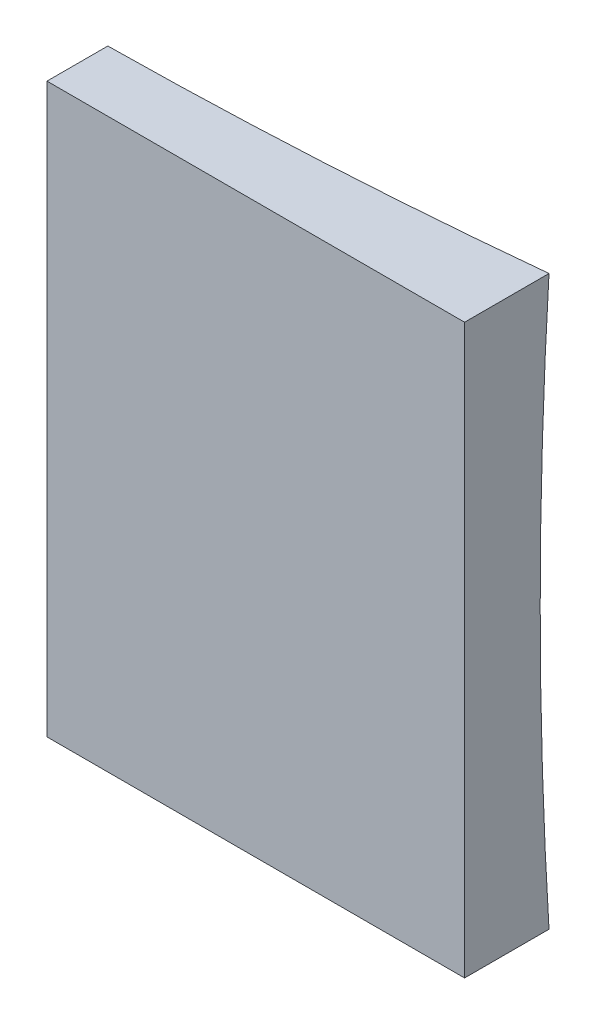
ISO-10303-21;
HEADER;
FILE_DESCRIPTION(('STEP AP214'),'2;1');
FILE_NAME('part.step','',(''),(''),'','','');
FILE_SCHEMA(('AUTOMOTIVE_DESIGN { 1 0 10303 214 1 1 1 1 }'));
ENDSEC;
DATA;
#1=APPLICATION_CONTEXT('core data for automotive mechanical design processes');
#2=APPLICATION_PROTOCOL_DEFINITION('international standard','automotive_design',2000,#1);
#3=PRODUCT_CONTEXT('',#1,'mechanical');
#4=PRODUCT('Part','Part','',(#3));
#5=PRODUCT_RELATED_PRODUCT_CATEGORY('part','',(#4));
#6=PRODUCT_DEFINITION_FORMATION('','',#4);
#7=PRODUCT_DEFINITION_CONTEXT('part definition',#1,'design');
#8=PRODUCT_DEFINITION('design','',#6,#7);
#9=PRODUCT_DEFINITION_SHAPE('','',#8);
#10=(LENGTH_UNIT() NAMED_UNIT(*) SI_UNIT(.MILLI.,.METRE.));
#11=(NAMED_UNIT(*) PLANE_ANGLE_UNIT() SI_UNIT($,.RADIAN.));
#12=(NAMED_UNIT(*) SI_UNIT($,.STERADIAN.) SOLID_ANGLE_UNIT());
#13=UNCERTAINTY_MEASURE_WITH_UNIT(LENGTH_MEASURE(1.E-05),#10,'distance_accuracy_value','');
#14=(GEOMETRIC_REPRESENTATION_CONTEXT(3) GLOBAL_UNCERTAINTY_ASSIGNED_CONTEXT((#13)) GLOBAL_UNIT_ASSIGNED_CONTEXT((#10,
#11,#12)) REPRESENTATION_CONTEXT('',''));
#15=CARTESIAN_POINT('',(0.,0.,0.));
#16=DIRECTION('',(0.,0.,1.));
#17=DIRECTION('',(1.,0.,0.));
#18=AXIS2_PLACEMENT_3D('',#15,#16,#17);
#19=CARTESIAN_POINT('',(28.,0.,-8.));
#20=DIRECTION('',(1.,0.,0.));
#21=DIRECTION('',(0.,0.,-1.));
#22=AXIS2_PLACEMENT_3D('',#19,#20,#21);
#23=PLANE('',#22);
#24=CARTESIAN_POINT('',(28.,17.,-278.5));
#25=DIRECTION('',(1.,0.,0.));
#26=DIRECTION('',(0.,0.,-1.));
#27=AXIS2_PLACEMENT_3D('',#24,#25,#26);
#28=CIRCLE('',#27,273.972918369681);
#29=CARTESIAN_POINT('',(28.,34.,-5.05501467388342));
#30=VERTEX_POINT('',#29);
#31=CARTESIAN_POINT('',(28.,0.,-5.05501467388347));
#32=VERTEX_POINT('',#31);
#33=EDGE_CURVE('E54',#30,#32,#28,.T.);
#34=ORIENTED_EDGE('',*,*,#33,.F.);
#35=DIRECTION('',(0.,0.,1.));
#36=VECTOR('',#35,1.);
#37=CARTESIAN_POINT('',(28.,34.,-8.));
#38=LINE('',#37,#36);
#39=CARTESIAN_POINT('',(28.,34.,0.));
#40=VERTEX_POINT('',#39);
#41=EDGE_CURVE('E98',#30,#40,#38,.T.);
#42=ORIENTED_EDGE('',*,*,#41,.T.);
#43=DIRECTION('',(0.,1.,0.));
#44=VECTOR('',#43,1.);
#45=CARTESIAN_POINT('',(28.,0.,0.));
#46=LINE('',#45,#44);
#47=CARTESIAN_POINT('',(28.,0.,0.));
#48=VERTEX_POINT('',#47);
#49=EDGE_CURVE('E90',#48,#40,#46,.T.);
#50=ORIENTED_EDGE('',*,*,#49,.F.);
#51=DIRECTION('',(0.,0.,1.));
#52=VECTOR('',#51,1.);
#53=CARTESIAN_POINT('',(28.,0.,-8.));
#54=LINE('',#53,#52);
#55=EDGE_CURVE('E88',#32,#48,#54,.T.);
#56=ORIENTED_EDGE('',*,*,#55,.F.);
#57=EDGE_LOOP('',(#34,#42,#50,#56));
#58=FACE_BOUND('',#57,.T.);
#59=ADVANCED_FACE('F32',(#58),#23,.T.);
#60=CARTESIAN_POINT('',(-28.,34.,0.));
#61=DIRECTION('',(0.,0.,-1.));
#62=DIRECTION('',(-1.,0.,0.));
#63=AXIS2_PLACEMENT_3D('',#60,#61,#62);
#64=PLANE('',#63);
#65=DIRECTION('',(-1.,0.,0.));
#66=VECTOR('',#65,1.);
#67=CARTESIAN_POINT('',(-28.,34.,0.));
#68=LINE('',#67,#66);
#69=CARTESIAN_POINT('',(3.,34.,0.));
#70=VERTEX_POINT('',#69);
#71=EDGE_CURVE('E85',#40,#70,#68,.T.);
#72=ORIENTED_EDGE('',*,*,#71,.T.);
#73=DIRECTION('',(0.,1.,0.));
#74=VECTOR('',#73,1.);
#75=CARTESIAN_POINT('',(3.,0.,0.));
#76=LINE('',#75,#74);
#77=CARTESIAN_POINT('',(3.,0.,0.));
#78=VERTEX_POINT('',#77);
#79=EDGE_CURVE('E74',#78,#70,#76,.T.);
#80=ORIENTED_EDGE('',*,*,#79,.F.);
#81=DIRECTION('',(1.,0.,0.));
#82=VECTOR('',#81,1.);
#83=CARTESIAN_POINT('',(-28.,0.,0.));
#84=LINE('',#83,#82);
#85=EDGE_CURVE('E82',#78,#48,#84,.T.);
#86=ORIENTED_EDGE('',*,*,#85,.T.);
#87=ORIENTED_EDGE('',*,*,#49,.T.);
#88=EDGE_LOOP('',(#72,#80,#86,#87));
#89=FACE_BOUND('',#88,.T.);
#90=ADVANCED_FACE('F80',(#89),#64,.F.);
#91=CARTESIAN_POINT('',(0.,17.,-278.5));
#92=DIRECTION('',(0.,1.,0.));
#93=DIRECTION('',(0.,0.,1.));
#94=AXIS2_PLACEMENT_3D('',#91,#92,#93);
#95=SPHERICAL_SURFACE('',#94,275.4);
#96=CARTESIAN_POINT('',(0.,0.,-278.5));
#97=DIRECTION('',(0.,-1.,0.));
#98=DIRECTION('',(0.,0.,-1.));
#99=AXIS2_PLACEMENT_3D('',#96,#97,#98);
#100=CIRCLE('',#99,274.874807867145);
#101=CARTESIAN_POINT('',(3.,0.,-3.64156370960694));
#102=VERTEX_POINT('',#101);
#103=EDGE_CURVE('E40',#32,#102,#100,.T.);
#104=ORIENTED_EDGE('',*,*,#103,.T.);
#105=CARTESIAN_POINT('',(3.,17.,-278.5));
#106=DIRECTION('',(1.,0.,0.));
#107=DIRECTION('',(0.,1.,0.));
#108=AXIS2_PLACEMENT_3D('',#105,#106,#107);
#109=CIRCLE('',#108,275.383659645957);
#110=CARTESIAN_POINT('',(3.,34.,-3.64156370960697));
#111=VERTEX_POINT('',#110);
#112=EDGE_CURVE('E11',#102,#111,#109,.F.);
#113=ORIENTED_EDGE('',*,*,#112,.T.);
#114=CARTESIAN_POINT('',(0.,34.,-278.5));
#115=DIRECTION('',(0.,1.,0.));
#116=DIRECTION('',(0.,0.,1.));
#117=AXIS2_PLACEMENT_3D('',#114,#115,#116);
#118=CIRCLE('',#117,274.874807867145);
#119=EDGE_CURVE('E91',#111,#30,#118,.T.);
#120=ORIENTED_EDGE('',*,*,#119,.T.);
#121=ORIENTED_EDGE('',*,*,#33,.T.);
#122=EDGE_LOOP('',(#104,#113,#120,#121));
#123=FACE_BOUND('',#122,.T.);
#124=ADVANCED_FACE('F100',(#123),#95,.F.);
#125=CARTESIAN_POINT('',(-28.,0.,-8.));
#126=DIRECTION('',(0.,-1.,0.));
#127=DIRECTION('',(0.,0.,-1.));
#128=AXIS2_PLACEMENT_3D('',#125,#126,#127);
#129=PLANE('',#128);
#130=DIRECTION('',(0.,0.,1.));
#131=VECTOR('',#130,1.);
#132=CARTESIAN_POINT('',(3.,0.,-5.05501467388347));
#133=LINE('',#132,#131);
#134=EDGE_CURVE('E71',#102,#78,#133,.T.);
#135=ORIENTED_EDGE('',*,*,#134,.F.);
#136=ORIENTED_EDGE('',*,*,#103,.F.);
#137=ORIENTED_EDGE('',*,*,#55,.T.);
#138=ORIENTED_EDGE('',*,*,#85,.F.);
#139=EDGE_LOOP('',(#135,#136,#137,#138));
#140=FACE_BOUND('',#139,.T.);
#141=ADVANCED_FACE('F34',(#140),#129,.T.);
#142=CARTESIAN_POINT('',(-28.,34.,-8.));
#143=DIRECTION('',(0.,1.,0.));
#144=DIRECTION('',(0.,0.,1.));
#145=AXIS2_PLACEMENT_3D('',#142,#143,#144);
#146=PLANE('',#145);
#147=DIRECTION('',(0.,0.,1.));
#148=VECTOR('',#147,1.);
#149=CARTESIAN_POINT('',(3.,34.,-5.05501467388347));
#150=LINE('',#149,#148);
#151=EDGE_CURVE('E47',#111,#70,#150,.T.);
#152=ORIENTED_EDGE('',*,*,#151,.T.);
#153=ORIENTED_EDGE('',*,*,#71,.F.);
#154=ORIENTED_EDGE('',*,*,#41,.F.);
#155=ORIENTED_EDGE('',*,*,#119,.F.);
#156=EDGE_LOOP('',(#152,#153,#154,#155));
#157=FACE_BOUND('',#156,.T.);
#158=ADVANCED_FACE('F105',(#157),#146,.T.);
#159=CARTESIAN_POINT('',(3.,0.,-5.05501467388347));
#160=DIRECTION('',(1.,0.,0.));
#161=DIRECTION('',(0.,1.,0.));
#162=AXIS2_PLACEMENT_3D('',#159,#160,#161);
#163=PLANE('',#162);
#164=ORIENTED_EDGE('',*,*,#134,.T.);
#165=ORIENTED_EDGE('',*,*,#79,.T.);
#166=ORIENTED_EDGE('',*,*,#151,.F.);
#167=ORIENTED_EDGE('',*,*,#112,.F.);
#168=EDGE_LOOP('',(#164,#165,#166,#167));
#169=FACE_BOUND('',#168,.T.);
#170=ADVANCED_FACE('F73',(#169),#163,.F.);
#171=CLOSED_SHELL('',(#59,#90,#124,#141,#158,#170));
#172=MANIFOLD_SOLID_BREP('B2',#171);
#173=ADVANCED_BREP_SHAPE_REPRESENTATION('',(#18,#172),#14);
#174=SHAPE_DEFINITION_REPRESENTATION(#9,#173);
ENDSEC;
END-ISO-10303-21;
